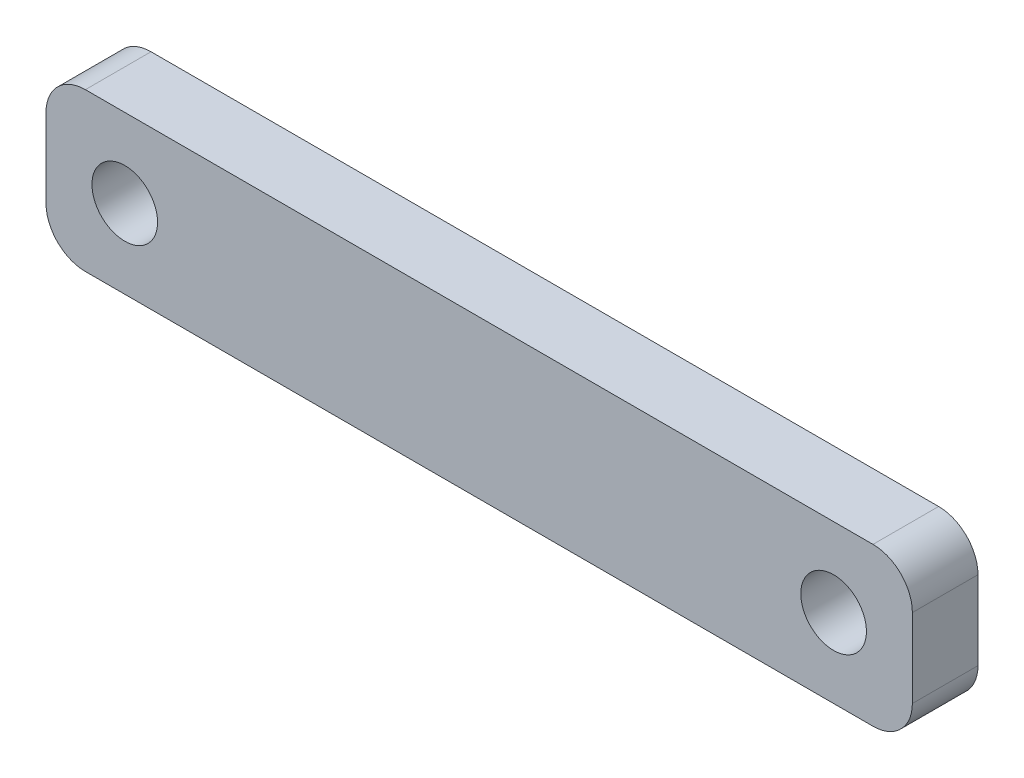
ISO-10303-21;
HEADER;
FILE_DESCRIPTION(('STEP AP214'),'2;1');
FILE_NAME('part.step','',(''),(''),'','','');
FILE_SCHEMA(('AUTOMOTIVE_DESIGN { 1 0 10303 214 1 1 1 1 }'));
ENDSEC;
DATA;
#1=APPLICATION_CONTEXT('core data for automotive mechanical design processes');
#2=APPLICATION_PROTOCOL_DEFINITION('international standard','automotive_design',2000,#1);
#3=PRODUCT_CONTEXT('',#1,'mechanical');
#4=PRODUCT('Part','Part','',(#3));
#5=PRODUCT_RELATED_PRODUCT_CATEGORY('part','',(#4));
#6=PRODUCT_DEFINITION_FORMATION('','',#4);
#7=PRODUCT_DEFINITION_CONTEXT('part definition',#1,'design');
#8=PRODUCT_DEFINITION('design','',#6,#7);
#9=PRODUCT_DEFINITION_SHAPE('','',#8);
#10=(LENGTH_UNIT() NAMED_UNIT(*) SI_UNIT(.MILLI.,.METRE.));
#11=(NAMED_UNIT(*) PLANE_ANGLE_UNIT() SI_UNIT($,.RADIAN.));
#12=(NAMED_UNIT(*) SI_UNIT($,.STERADIAN.) SOLID_ANGLE_UNIT());
#13=UNCERTAINTY_MEASURE_WITH_UNIT(LENGTH_MEASURE(1.E-05),#10,'distance_accuracy_value','');
#14=(GEOMETRIC_REPRESENTATION_CONTEXT(3) GLOBAL_UNCERTAINTY_ASSIGNED_CONTEXT((#13)) GLOBAL_UNIT_ASSIGNED_CONTEXT((#10,
#11,#12)) REPRESENTATION_CONTEXT('',''));
#15=CARTESIAN_POINT('',(0.,0.,0.));
#16=DIRECTION('',(0.,0.,1.));
#17=DIRECTION('',(1.,0.,0.));
#18=AXIS2_PLACEMENT_3D('',#15,#16,#17);
#19=CARTESIAN_POINT('',(-22.0661342634266,-8.04115016880375,5.));
#20=DIRECTION('',(0.,0.,-1.));
#21=DIRECTION('',(-1.,0.,0.));
#22=AXIS2_PLACEMENT_3D('',#19,#20,#21);
#23=PLANE('',#22);
#24=CARTESIAN_POINT('',(-22.0661342634266,-8.04115016880375,5.));
#25=DIRECTION('',(0.,0.,1.));
#26=DIRECTION('',(-1.,0.,0.));
#27=AXIS2_PLACEMENT_3D('',#24,#25,#26);
#28=CIRCLE('',#27,3.);
#29=CARTESIAN_POINT('',(-22.0661342634266,-5.04115016880374,5.));
#30=VERTEX_POINT('',#29);
#31=CARTESIAN_POINT('',(-25.0661342634266,-8.04115016880374,5.));
#32=VERTEX_POINT('',#31);
#33=EDGE_CURVE('E147',#30,#32,#28,.T.);
#34=ORIENTED_EDGE('',*,*,#33,.T.);
#35=DIRECTION('',(0.,-1.,0.));
#36=VECTOR('',#35,1.);
#37=CARTESIAN_POINT('',(-25.0661342634266,-14.0411501688038,5.));
#38=LINE('',#37,#36);
#39=CARTESIAN_POINT('',(-25.0661342634266,-14.0411501688037,5.));
#40=VERTEX_POINT('',#39);
#41=EDGE_CURVE('E95',#32,#40,#38,.T.);
#42=ORIENTED_EDGE('',*,*,#41,.T.);
#43=CARTESIAN_POINT('',(-22.0661342634266,-14.0411501688037,5.));
#44=DIRECTION('',(0.,0.,1.));
#45=DIRECTION('',(-1.,0.,0.));
#46=AXIS2_PLACEMENT_3D('',#43,#44,#45);
#47=CIRCLE('',#46,3.);
#48=CARTESIAN_POINT('',(-22.0661342634266,-17.0411501688037,5.));
#49=VERTEX_POINT('',#48);
#50=EDGE_CURVE('E162',#40,#49,#47,.T.);
#51=ORIENTED_EDGE('',*,*,#50,.T.);
#52=DIRECTION('',(1.,0.,0.));
#53=VECTOR('',#52,1.);
#54=CARTESIAN_POINT('',(37.9338657365734,-17.0411501688037,5.));
#55=LINE('',#54,#53);
#56=CARTESIAN_POINT('',(37.9338657365734,-17.0411501688037,5.));
#57=VERTEX_POINT('',#56);
#58=EDGE_CURVE('E175',#49,#57,#55,.T.);
#59=ORIENTED_EDGE('',*,*,#58,.T.);
#60=CARTESIAN_POINT('',(37.9338657365734,-14.0411501688037,5.));
#61=DIRECTION('',(0.,0.,1.));
#62=DIRECTION('',(-1.,0.,0.));
#63=AXIS2_PLACEMENT_3D('',#60,#61,#62);
#64=CIRCLE('',#63,3.00000000000001);
#65=CARTESIAN_POINT('',(40.9338657365734,-14.0411501688037,5.));
#66=VERTEX_POINT('',#65);
#67=EDGE_CURVE('E114',#57,#66,#64,.T.);
#68=ORIENTED_EDGE('',*,*,#67,.T.);
#69=DIRECTION('',(0.,1.,0.));
#70=VECTOR('',#69,1.);
#71=CARTESIAN_POINT('',(40.9338657365734,-8.04115016880374,5.));
#72=LINE('',#71,#70);
#73=CARTESIAN_POINT('',(40.9338657365734,-8.04115016880374,5.));
#74=VERTEX_POINT('',#73);
#75=EDGE_CURVE('E108',#66,#74,#72,.T.);
#76=ORIENTED_EDGE('',*,*,#75,.T.);
#77=CARTESIAN_POINT('',(37.9338657365734,-8.04115016880374,5.));
#78=DIRECTION('',(0.,0.,1.));
#79=DIRECTION('',(-1.,0.,0.));
#80=AXIS2_PLACEMENT_3D('',#77,#78,#79);
#81=CIRCLE('',#80,3.);
#82=CARTESIAN_POINT('',(37.9338657365734,-5.04115016880375,5.));
#83=VERTEX_POINT('',#82);
#84=EDGE_CURVE('E112',#74,#83,#81,.T.);
#85=ORIENTED_EDGE('',*,*,#84,.T.);
#86=DIRECTION('',(-1.,0.,0.));
#87=VECTOR('',#86,1.);
#88=CARTESIAN_POINT('',(-22.0661342634266,-5.04115016880374,5.));
#89=LINE('',#88,#87);
#90=EDGE_CURVE('E52',#83,#30,#89,.T.);
#91=ORIENTED_EDGE('',*,*,#90,.T.);
#92=EDGE_LOOP('',(#34,#42,#51,#59,#68,#76,#85,#91));
#93=FACE_BOUND('',#92,.T.);
#94=CARTESIAN_POINT('',(-19.0661342634266,-11.0411501688038,5.));
#95=DIRECTION('',(0.,0.,1.));
#96=DIRECTION('',(1.,0.,0.));
#97=AXIS2_PLACEMENT_3D('',#94,#95,#96);
#98=CIRCLE('',#97,2.5);
#99=CARTESIAN_POINT('',(-16.5661342634266,-11.0411501688038,5.));
#100=VERTEX_POINT('',#99);
#101=EDGE_CURVE('E136',#100,#100,#98,.T.);
#102=ORIENTED_EDGE('',*,*,#101,.F.);
#103=EDGE_LOOP('',(#102));
#104=FACE_BOUND('',#103,.T.);
#105=CARTESIAN_POINT('',(34.9338657365734,-11.0411501688038,5.));
#106=DIRECTION('',(0.,0.,1.));
#107=DIRECTION('',(-1.,0.,0.));
#108=AXIS2_PLACEMENT_3D('',#105,#106,#107);
#109=CIRCLE('',#108,2.5);
#110=CARTESIAN_POINT('',(32.4338657365734,-11.0411501688038,5.));
#111=VERTEX_POINT('',#110);
#112=EDGE_CURVE('E184',#111,#111,#109,.T.);
#113=ORIENTED_EDGE('',*,*,#112,.F.);
#114=EDGE_LOOP('',(#113));
#115=FACE_BOUND('',#114,.T.);
#116=ADVANCED_FACE('F35',(#93,#104,#115),#23,.F.);
#117=CARTESIAN_POINT('',(-22.0661342634266,-8.04115016880375,0.));
#118=DIRECTION('',(0.,0.,-1.));
#119=DIRECTION('',(-1.,0.,0.));
#120=AXIS2_PLACEMENT_3D('',#117,#118,#119);
#121=PLANE('',#120);
#122=CARTESIAN_POINT('',(-19.0661342634266,-11.0411501688038,0.));
#123=DIRECTION('',(0.,0.,1.));
#124=DIRECTION('',(1.,0.,0.));
#125=AXIS2_PLACEMENT_3D('',#122,#123,#124);
#126=CIRCLE('',#125,2.5);
#127=CARTESIAN_POINT('',(-16.5661342634266,-11.0411501688038,0.));
#128=VERTEX_POINT('',#127);
#129=EDGE_CURVE('E181',#128,#128,#126,.T.);
#130=ORIENTED_EDGE('',*,*,#129,.T.);
#131=EDGE_LOOP('',(#130));
#132=FACE_BOUND('',#131,.T.);
#133=CARTESIAN_POINT('',(-22.0661342634266,-8.04115016880375,0.));
#134=DIRECTION('',(0.,0.,1.));
#135=DIRECTION('',(-1.,0.,0.));
#136=AXIS2_PLACEMENT_3D('',#133,#134,#135);
#137=CIRCLE('',#136,3.);
#138=CARTESIAN_POINT('',(-22.0661342634266,-5.04115016880374,0.));
#139=VERTEX_POINT('',#138);
#140=CARTESIAN_POINT('',(-25.0661342634266,-8.04115016880374,0.));
#141=VERTEX_POINT('',#140);
#142=EDGE_CURVE('E132',#139,#141,#137,.T.);
#143=ORIENTED_EDGE('',*,*,#142,.F.);
#144=DIRECTION('',(-1.,0.,0.));
#145=VECTOR('',#144,1.);
#146=CARTESIAN_POINT('',(-22.0661342634266,-5.04115016880374,0.));
#147=LINE('',#146,#145);
#148=CARTESIAN_POINT('',(37.9338657365734,-5.04115016880375,0.));
#149=VERTEX_POINT('',#148);
#150=EDGE_CURVE('E87',#149,#139,#147,.T.);
#151=ORIENTED_EDGE('',*,*,#150,.F.);
#152=CARTESIAN_POINT('',(37.9338657365734,-8.04115016880374,0.));
#153=DIRECTION('',(0.,0.,1.));
#154=DIRECTION('',(-1.,0.,0.));
#155=AXIS2_PLACEMENT_3D('',#152,#153,#154);
#156=CIRCLE('',#155,3.);
#157=CARTESIAN_POINT('',(40.9338657365734,-8.04115016880374,0.));
#158=VERTEX_POINT('',#157);
#159=EDGE_CURVE('E81',#158,#149,#156,.T.);
#160=ORIENTED_EDGE('',*,*,#159,.F.);
#161=DIRECTION('',(0.,1.,0.));
#162=VECTOR('',#161,1.);
#163=CARTESIAN_POINT('',(40.9338657365734,-8.04115016880374,0.));
#164=LINE('',#163,#162);
#165=CARTESIAN_POINT('',(40.9338657365734,-14.0411501688037,0.));
#166=VERTEX_POINT('',#165);
#167=EDGE_CURVE('E122',#166,#158,#164,.T.);
#168=ORIENTED_EDGE('',*,*,#167,.F.);
#169=CARTESIAN_POINT('',(37.9338657365734,-14.0411501688037,0.));
#170=DIRECTION('',(0.,0.,1.));
#171=DIRECTION('',(-1.,0.,0.));
#172=AXIS2_PLACEMENT_3D('',#169,#170,#171);
#173=CIRCLE('',#172,3.00000000000001);
#174=CARTESIAN_POINT('',(37.9338657365734,-17.0411501688037,0.));
#175=VERTEX_POINT('',#174);
#176=EDGE_CURVE('E142',#175,#166,#173,.T.);
#177=ORIENTED_EDGE('',*,*,#176,.F.);
#178=DIRECTION('',(1.,0.,0.));
#179=VECTOR('',#178,1.);
#180=CARTESIAN_POINT('',(37.9338657365734,-17.0411501688037,0.));
#181=LINE('',#180,#179);
#182=CARTESIAN_POINT('',(-22.0661342634266,-17.0411501688037,0.));
#183=VERTEX_POINT('',#182);
#184=EDGE_CURVE('E140',#183,#175,#181,.T.);
#185=ORIENTED_EDGE('',*,*,#184,.F.);
#186=CARTESIAN_POINT('',(-22.0661342634266,-14.0411501688037,0.));
#187=DIRECTION('',(0.,0.,1.));
#188=DIRECTION('',(-1.,0.,0.));
#189=AXIS2_PLACEMENT_3D('',#186,#187,#188);
#190=CIRCLE('',#189,3.);
#191=CARTESIAN_POINT('',(-25.0661342634266,-14.0411501688037,0.));
#192=VERTEX_POINT('',#191);
#193=EDGE_CURVE('E138',#192,#183,#190,.T.);
#194=ORIENTED_EDGE('',*,*,#193,.F.);
#195=DIRECTION('',(0.,-1.,0.));
#196=VECTOR('',#195,1.);
#197=CARTESIAN_POINT('',(-25.0661342634266,-14.0411501688038,0.));
#198=LINE('',#197,#196);
#199=EDGE_CURVE('E135',#141,#192,#198,.T.);
#200=ORIENTED_EDGE('',*,*,#199,.F.);
#201=EDGE_LOOP('',(#143,#151,#160,#168,#177,#185,#194,#200));
#202=FACE_BOUND('',#201,.T.);
#203=CARTESIAN_POINT('',(34.9338657365734,-11.0411501688038,0.));
#204=DIRECTION('',(0.,0.,1.));
#205=DIRECTION('',(-1.,0.,0.));
#206=AXIS2_PLACEMENT_3D('',#203,#204,#205);
#207=CIRCLE('',#206,2.5);
#208=CARTESIAN_POINT('',(32.4338657365734,-11.0411501688038,0.));
#209=VERTEX_POINT('',#208);
#210=EDGE_CURVE('E187',#209,#209,#207,.T.);
#211=ORIENTED_EDGE('',*,*,#210,.T.);
#212=EDGE_LOOP('',(#211));
#213=FACE_BOUND('',#212,.T.);
#214=ADVANCED_FACE('F166',(#132,#202,#213),#121,.T.);
#215=CARTESIAN_POINT('',(-22.0661342634266,-8.04115016880375,5.));
#216=DIRECTION('',(0.,0.,-1.));
#217=DIRECTION('',(-1.,0.,0.));
#218=AXIS2_PLACEMENT_3D('',#215,#216,#217);
#219=CYLINDRICAL_SURFACE('',#218,3.);
#220=ORIENTED_EDGE('',*,*,#142,.T.);
#221=DIRECTION('',(0.,0.,-1.));
#222=VECTOR('',#221,1.);
#223=CARTESIAN_POINT('',(-25.0661342634266,-8.04115016880374,5.));
#224=LINE('',#223,#222);
#225=EDGE_CURVE('E11',#32,#141,#224,.T.);
#226=ORIENTED_EDGE('',*,*,#225,.F.);
#227=ORIENTED_EDGE('',*,*,#33,.F.);
#228=DIRECTION('',(0.,0.,-1.));
#229=VECTOR('',#228,1.);
#230=CARTESIAN_POINT('',(-22.0661342634266,-5.04115016880374,5.));
#231=LINE('',#230,#229);
#232=EDGE_CURVE('E128',#30,#139,#231,.T.);
#233=ORIENTED_EDGE('',*,*,#232,.T.);
#234=EDGE_LOOP('',(#220,#226,#227,#233));
#235=FACE_BOUND('',#234,.T.);
#236=ADVANCED_FACE('F37',(#235),#219,.T.);
#237=CARTESIAN_POINT('',(-25.0661342634266,-14.0411501688038,5.));
#238=DIRECTION('',(1.,0.,0.));
#239=DIRECTION('',(0.,1.,0.));
#240=AXIS2_PLACEMENT_3D('',#237,#238,#239);
#241=PLANE('',#240);
#242=ORIENTED_EDGE('',*,*,#199,.T.);
#243=DIRECTION('',(0.,0.,-1.));
#244=VECTOR('',#243,1.);
#245=CARTESIAN_POINT('',(-25.0661342634266,-14.0411501688037,5.));
#246=LINE('',#245,#244);
#247=EDGE_CURVE('E44',#40,#192,#246,.T.);
#248=ORIENTED_EDGE('',*,*,#247,.F.);
#249=ORIENTED_EDGE('',*,*,#41,.F.);
#250=ORIENTED_EDGE('',*,*,#225,.T.);
#251=EDGE_LOOP('',(#242,#248,#249,#250));
#252=FACE_BOUND('',#251,.T.);
#253=ADVANCED_FACE('F219',(#252),#241,.F.);
#254=CARTESIAN_POINT('',(-22.0661342634266,-14.0411501688037,5.));
#255=DIRECTION('',(0.,0.,-1.));
#256=DIRECTION('',(-1.,0.,0.));
#257=AXIS2_PLACEMENT_3D('',#254,#255,#256);
#258=CYLINDRICAL_SURFACE('',#257,3.);
#259=ORIENTED_EDGE('',*,*,#193,.T.);
#260=DIRECTION('',(0.,0.,-1.));
#261=VECTOR('',#260,1.);
#262=CARTESIAN_POINT('',(-22.0661342634266,-17.0411501688037,5.));
#263=LINE('',#262,#261);
#264=EDGE_CURVE('E154',#49,#183,#263,.T.);
#265=ORIENTED_EDGE('',*,*,#264,.F.);
#266=ORIENTED_EDGE('',*,*,#50,.F.);
#267=ORIENTED_EDGE('',*,*,#247,.T.);
#268=EDGE_LOOP('',(#259,#265,#266,#267));
#269=FACE_BOUND('',#268,.T.);
#270=ADVANCED_FACE('F160',(#269),#258,.T.);
#271=CARTESIAN_POINT('',(37.9338657365734,-17.0411501688037,5.));
#272=DIRECTION('',(0.,1.,0.));
#273=DIRECTION('',(0.,0.,1.));
#274=AXIS2_PLACEMENT_3D('',#271,#272,#273);
#275=PLANE('',#274);
#276=ORIENTED_EDGE('',*,*,#184,.T.);
#277=DIRECTION('',(0.,0.,-1.));
#278=VECTOR('',#277,1.);
#279=CARTESIAN_POINT('',(37.9338657365734,-17.0411501688037,5.));
#280=LINE('',#279,#278);
#281=EDGE_CURVE('E151',#57,#175,#280,.T.);
#282=ORIENTED_EDGE('',*,*,#281,.F.);
#283=ORIENTED_EDGE('',*,*,#58,.F.);
#284=ORIENTED_EDGE('',*,*,#264,.T.);
#285=EDGE_LOOP('',(#276,#282,#283,#284));
#286=FACE_BOUND('',#285,.T.);
#287=ADVANCED_FACE('F171',(#286),#275,.F.);
#288=CARTESIAN_POINT('',(37.9338657365734,-14.0411501688037,5.));
#289=DIRECTION('',(0.,0.,-1.));
#290=DIRECTION('',(-1.,0.,0.));
#291=AXIS2_PLACEMENT_3D('',#288,#289,#290);
#292=CYLINDRICAL_SURFACE('',#291,3.00000000000001);
#293=ORIENTED_EDGE('',*,*,#176,.T.);
#294=DIRECTION('',(0.,0.,-1.));
#295=VECTOR('',#294,1.);
#296=CARTESIAN_POINT('',(40.9338657365734,-14.0411501688037,5.));
#297=LINE('',#296,#295);
#298=EDGE_CURVE('E123',#66,#166,#297,.T.);
#299=ORIENTED_EDGE('',*,*,#298,.F.);
#300=ORIENTED_EDGE('',*,*,#67,.F.);
#301=ORIENTED_EDGE('',*,*,#281,.T.);
#302=EDGE_LOOP('',(#293,#299,#300,#301));
#303=FACE_BOUND('',#302,.T.);
#304=ADVANCED_FACE('F174',(#303),#292,.T.);
#305=CARTESIAN_POINT('',(40.9338657365734,-8.04115016880374,5.));
#306=DIRECTION('',(-1.,0.,0.));
#307=DIRECTION('',(0.,0.,1.));
#308=AXIS2_PLACEMENT_3D('',#305,#306,#307);
#309=PLANE('',#308);
#310=ORIENTED_EDGE('',*,*,#167,.T.);
#311=DIRECTION('',(0.,0.,-1.));
#312=VECTOR('',#311,1.);
#313=CARTESIAN_POINT('',(40.9338657365734,-8.04115016880374,5.));
#314=LINE('',#313,#312);
#315=EDGE_CURVE('E119',#74,#158,#314,.T.);
#316=ORIENTED_EDGE('',*,*,#315,.F.);
#317=ORIENTED_EDGE('',*,*,#75,.F.);
#318=ORIENTED_EDGE('',*,*,#298,.T.);
#319=EDGE_LOOP('',(#310,#316,#317,#318));
#320=FACE_BOUND('',#319,.T.);
#321=ADVANCED_FACE('F120',(#320),#309,.F.);
#322=CARTESIAN_POINT('',(37.9338657365734,-8.04115016880374,5.));
#323=DIRECTION('',(0.,0.,-1.));
#324=DIRECTION('',(-1.,0.,0.));
#325=AXIS2_PLACEMENT_3D('',#322,#323,#324);
#326=CYLINDRICAL_SURFACE('',#325,3.);
#327=ORIENTED_EDGE('',*,*,#159,.T.);
#328=DIRECTION('',(0.,0.,-1.));
#329=VECTOR('',#328,1.);
#330=CARTESIAN_POINT('',(37.9338657365734,-5.04115016880375,5.));
#331=LINE('',#330,#329);
#332=EDGE_CURVE('E124',#83,#149,#331,.T.);
#333=ORIENTED_EDGE('',*,*,#332,.F.);
#334=ORIENTED_EDGE('',*,*,#84,.F.);
#335=ORIENTED_EDGE('',*,*,#315,.T.);
#336=EDGE_LOOP('',(#327,#333,#334,#335));
#337=FACE_BOUND('',#336,.T.);
#338=ADVANCED_FACE('F126',(#337),#326,.T.);
#339=CARTESIAN_POINT('',(-22.0661342634266,-5.04115016880374,5.));
#340=DIRECTION('',(0.,-1.,0.));
#341=DIRECTION('',(1.,0.,0.));
#342=AXIS2_PLACEMENT_3D('',#339,#340,#341);
#343=PLANE('',#342);
#344=ORIENTED_EDGE('',*,*,#150,.T.);
#345=ORIENTED_EDGE('',*,*,#232,.F.);
#346=ORIENTED_EDGE('',*,*,#90,.F.);
#347=ORIENTED_EDGE('',*,*,#332,.T.);
#348=EDGE_LOOP('',(#344,#345,#346,#347));
#349=FACE_BOUND('',#348,.T.);
#350=ADVANCED_FACE('F207',(#349),#343,.F.);
#351=CARTESIAN_POINT('',(-19.0661342634266,-11.0411501688038,5.));
#352=DIRECTION('',(0.,0.,-1.));
#353=DIRECTION('',(-1.,0.,0.));
#354=AXIS2_PLACEMENT_3D('',#351,#352,#353);
#355=CYLINDRICAL_SURFACE('',#354,2.5);
#356=ORIENTED_EDGE('',*,*,#101,.T.);
#357=EDGE_LOOP('',(#356));
#358=FACE_BOUND('',#357,.T.);
#359=ORIENTED_EDGE('',*,*,#129,.F.);
#360=EDGE_LOOP('',(#359));
#361=FACE_BOUND('',#360,.T.);
#362=ADVANCED_FACE('F204',(#358,#361),#355,.F.);
#363=CARTESIAN_POINT('',(34.9338657365734,-11.0411501688038,5.));
#364=DIRECTION('',(0.,0.,-1.));
#365=DIRECTION('',(-1.,0.,0.));
#366=AXIS2_PLACEMENT_3D('',#363,#364,#365);
#367=CYLINDRICAL_SURFACE('',#366,2.5);
#368=ORIENTED_EDGE('',*,*,#112,.T.);
#369=EDGE_LOOP('',(#368));
#370=FACE_BOUND('',#369,.T.);
#371=ORIENTED_EDGE('',*,*,#210,.F.);
#372=EDGE_LOOP('',(#371));
#373=FACE_BOUND('',#372,.T.);
#374=ADVANCED_FACE('F193',(#370,#373),#367,.F.);
#375=CLOSED_SHELL('',(#116,#214,#236,#253,#270,#287,#304,#321,#338,#350,#362,#374));
#376=MANIFOLD_SOLID_BREP('B2',#375);
#377=ADVANCED_BREP_SHAPE_REPRESENTATION('',(#18,#376),#14);
#378=SHAPE_DEFINITION_REPRESENTATION(#9,#377);
ENDSEC;
END-ISO-10303-21;
